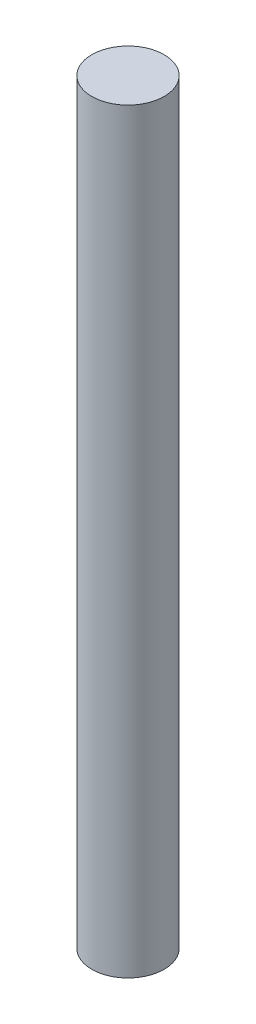
ISO-10303-21;
HEADER;
FILE_DESCRIPTION(('STEP AP214'),'2;1');
FILE_NAME('part.step','',(''),(''),'','','');
FILE_SCHEMA(('AUTOMOTIVE_DESIGN { 1 0 10303 214 1 1 1 1 }'));
ENDSEC;
DATA;
#1=APPLICATION_CONTEXT('core data for automotive mechanical design processes');
#2=APPLICATION_PROTOCOL_DEFINITION('international standard','automotive_design',2000,#1);
#3=PRODUCT_CONTEXT('',#1,'mechanical');
#4=PRODUCT('Part','Part','',(#3));
#5=PRODUCT_RELATED_PRODUCT_CATEGORY('part','',(#4));
#6=PRODUCT_DEFINITION_FORMATION('','',#4);
#7=PRODUCT_DEFINITION_CONTEXT('part definition',#1,'design');
#8=PRODUCT_DEFINITION('design','',#6,#7);
#9=PRODUCT_DEFINITION_SHAPE('','',#8);
#10=(LENGTH_UNIT() NAMED_UNIT(*) SI_UNIT(.MILLI.,.METRE.));
#11=(NAMED_UNIT(*) PLANE_ANGLE_UNIT() SI_UNIT($,.RADIAN.));
#12=(NAMED_UNIT(*) SI_UNIT($,.STERADIAN.) SOLID_ANGLE_UNIT());
#13=UNCERTAINTY_MEASURE_WITH_UNIT(LENGTH_MEASURE(1.E-05),#10,'distance_accuracy_value','');
#14=(GEOMETRIC_REPRESENTATION_CONTEXT(3) GLOBAL_UNCERTAINTY_ASSIGNED_CONTEXT((#13)) GLOBAL_UNIT_ASSIGNED_CONTEXT((#10,
#11,#12)) REPRESENTATION_CONTEXT('',''));
#15=CARTESIAN_POINT('',(0.,0.,0.));
#16=DIRECTION('',(0.,0.,1.));
#17=DIRECTION('',(1.,0.,0.));
#18=AXIS2_PLACEMENT_3D('',#15,#16,#17);
#19=CARTESIAN_POINT('',(0.,52.2,0.));
#20=DIRECTION('',(0.,-1.,0.));
#21=DIRECTION('',(0.,0.,-1.));
#22=AXIS2_PLACEMENT_3D('',#19,#20,#21);
#23=CYLINDRICAL_SURFACE('',#22,2.5);
#24=CARTESIAN_POINT('',(0.,52.2,0.));
#25=DIRECTION('',(0.,1.,0.));
#26=DIRECTION('',(0.,0.,1.));
#27=AXIS2_PLACEMENT_3D('',#24,#25,#26);
#28=CIRCLE('',#27,2.5);
#29=CARTESIAN_POINT('',(0.,52.2,2.5));
#30=VERTEX_POINT('',#29);
#31=EDGE_CURVE('E10',#30,#30,#28,.T.);
#32=ORIENTED_EDGE('',*,*,#31,.F.);
#33=EDGE_LOOP('',(#32));
#34=FACE_BOUND('',#33,.T.);
#35=CARTESIAN_POINT('',(0.,0.,0.));
#36=DIRECTION('',(0.,1.,0.));
#37=DIRECTION('',(0.,0.,1.));
#38=AXIS2_PLACEMENT_3D('',#35,#36,#37);
#39=CIRCLE('',#38,2.5);
#40=CARTESIAN_POINT('',(0.,0.,2.5));
#41=VERTEX_POINT('',#40);
#42=EDGE_CURVE('E34',#41,#41,#39,.T.);
#43=ORIENTED_EDGE('',*,*,#42,.T.);
#44=EDGE_LOOP('',(#43));
#45=FACE_BOUND('',#44,.T.);
#46=ADVANCED_FACE('F31',(#34,#45),#23,.T.);
#47=CARTESIAN_POINT('',(0.,52.2,0.));
#48=DIRECTION('',(0.,1.,0.));
#49=DIRECTION('',(0.,0.,1.));
#50=AXIS2_PLACEMENT_3D('',#47,#48,#49);
#51=PLANE('',#50);
#52=ORIENTED_EDGE('',*,*,#31,.T.);
#53=EDGE_LOOP('',(#52));
#54=FACE_BOUND('',#53,.T.);
#55=ADVANCED_FACE('F46',(#54),#51,.T.);
#56=CARTESIAN_POINT('',(0.,0.,0.));
#57=DIRECTION('',(0.,1.,0.));
#58=DIRECTION('',(0.,0.,1.));
#59=AXIS2_PLACEMENT_3D('',#56,#57,#58);
#60=PLANE('',#59);
#61=ORIENTED_EDGE('',*,*,#42,.F.);
#62=EDGE_LOOP('',(#61));
#63=FACE_BOUND('',#62,.T.);
#64=ADVANCED_FACE('F44',(#63),#60,.F.);
#65=CLOSED_SHELL('',(#46,#55,#64));
#66=MANIFOLD_SOLID_BREP('B2',#65);
#67=ADVANCED_BREP_SHAPE_REPRESENTATION('',(#18,#66),#14);
#68=SHAPE_DEFINITION_REPRESENTATION(#9,#67);
ENDSEC;
END-ISO-10303-21;
